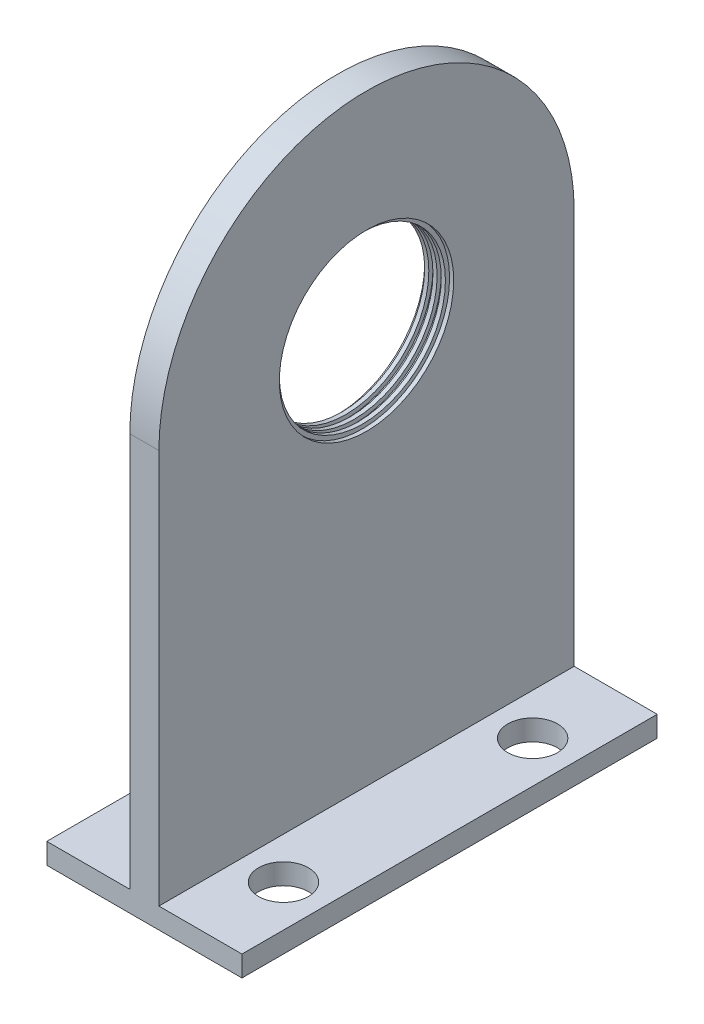
ISO-10303-21;
HEADER;
FILE_DESCRIPTION(('STEP AP214'),'2;1');
FILE_NAME('part.step','',(''),(''),'','','');
FILE_SCHEMA(('AUTOMOTIVE_DESIGN { 1 0 10303 214 1 1 1 1 }'));
ENDSEC;
DATA;
#1=APPLICATION_CONTEXT('core data for automotive mechanical design processes');
#2=APPLICATION_PROTOCOL_DEFINITION('international standard','automotive_design',2000,#1);
#3=PRODUCT_CONTEXT('',#1,'mechanical');
#4=PRODUCT('Part','Part','',(#3));
#5=PRODUCT_RELATED_PRODUCT_CATEGORY('part','',(#4));
#6=PRODUCT_DEFINITION_FORMATION('','',#4);
#7=PRODUCT_DEFINITION_CONTEXT('part definition',#1,'design');
#8=PRODUCT_DEFINITION('design','',#6,#7);
#9=PRODUCT_DEFINITION_SHAPE('','',#8);
#10=(LENGTH_UNIT() NAMED_UNIT(*) SI_UNIT(.MILLI.,.METRE.));
#11=(NAMED_UNIT(*) PLANE_ANGLE_UNIT() SI_UNIT($,.RADIAN.));
#12=(NAMED_UNIT(*) SI_UNIT($,.STERADIAN.) SOLID_ANGLE_UNIT());
#13=UNCERTAINTY_MEASURE_WITH_UNIT(LENGTH_MEASURE(1.E-05),#10,'distance_accuracy_value','');
#14=(GEOMETRIC_REPRESENTATION_CONTEXT(3) GLOBAL_UNCERTAINTY_ASSIGNED_CONTEXT((#13)) GLOBAL_UNIT_ASSIGNED_CONTEXT((#10,
#11,#12)) REPRESENTATION_CONTEXT('',''));
#15=CARTESIAN_POINT('',(0.,0.,0.));
#16=DIRECTION('',(0.,0.,1.));
#17=DIRECTION('',(1.,0.,0.));
#18=AXIS2_PLACEMENT_3D('',#15,#16,#17);
#19=CARTESIAN_POINT('',(0.7,10.,0.));
#20=DIRECTION('',(-1.,0.,0.));
#21=DIRECTION('',(0.,0.,1.));
#22=AXIS2_PLACEMENT_3D('',#19,#20,#21);
#23=CYLINDRICAL_SURFACE('',#22,2.);
#24=CARTESIAN_POINT('',(0.1,10.,0.));
#25=DIRECTION('',(1.,0.,0.));
#26=DIRECTION('',(0.,0.,-1.));
#27=AXIS2_PLACEMENT_3D('',#24,#25,#26);
#28=CIRCLE('',#27,2.);
#29=CARTESIAN_POINT('',(0.1,10.,-1.99999999999999));
#30=VERTEX_POINT('',#29);
#31=EDGE_CURVE('E178',#30,#30,#28,.T.);
#32=ORIENTED_EDGE('',*,*,#31,.F.);
#33=EDGE_LOOP('',(#32));
#34=FACE_BOUND('',#33,.T.);
#35=CARTESIAN_POINT('',(0.2,10.,0.));
#36=DIRECTION('',(1.,0.,0.));
#37=DIRECTION('',(0.,0.,-1.));
#38=AXIS2_PLACEMENT_3D('',#35,#36,#37);
#39=CIRCLE('',#38,2.);
#40=CARTESIAN_POINT('',(0.2,10.,-1.99999999999999));
#41=VERTEX_POINT('',#40);
#42=EDGE_CURVE('E43',#41,#41,#39,.T.);
#43=ORIENTED_EDGE('',*,*,#42,.T.);
#44=EDGE_LOOP('',(#43));
#45=FACE_BOUND('',#44,.T.);
#46=ADVANCED_FACE('F39',(#34,#45),#23,.F.);
#47=CARTESIAN_POINT('',(0.3,10.,0.));
#48=DIRECTION('',(1.,0.,0.));
#49=DIRECTION('',(0.,0.,-1.));
#50=AXIS2_PLACEMENT_3D('',#47,#48,#49);
#51=CIRCLE('',#50,2.);
#52=CARTESIAN_POINT('',(0.3,10.,-1.99999999999999));
#53=VERTEX_POINT('',#52);
#54=EDGE_CURVE('E157',#53,#53,#51,.T.);
#55=ORIENTED_EDGE('',*,*,#54,.F.);
#56=EDGE_LOOP('',(#55));
#57=FACE_BOUND('',#56,.T.);
#58=CARTESIAN_POINT('',(0.4,10.,0.));
#59=DIRECTION('',(1.,0.,0.));
#60=DIRECTION('',(0.,0.,-1.));
#61=AXIS2_PLACEMENT_3D('',#58,#59,#60);
#62=CIRCLE('',#61,2.);
#63=CARTESIAN_POINT('',(0.4,10.,-1.99999999999999));
#64=VERTEX_POINT('',#63);
#65=EDGE_CURVE('E174',#64,#64,#62,.T.);
#66=ORIENTED_EDGE('',*,*,#65,.T.);
#67=EDGE_LOOP('',(#66));
#68=FACE_BOUND('',#67,.T.);
#69=ADVANCED_FACE('F238',(#57,#68),#23,.F.);
#70=CARTESIAN_POINT('',(0.5,10.,0.));
#71=DIRECTION('',(1.,0.,0.));
#72=DIRECTION('',(0.,0.,-1.));
#73=AXIS2_PLACEMENT_3D('',#70,#71,#72);
#74=CIRCLE('',#73,2.);
#75=CARTESIAN_POINT('',(0.5,10.,-1.99999999999999));
#76=VERTEX_POINT('',#75);
#77=EDGE_CURVE('E163',#76,#76,#74,.T.);
#78=ORIENTED_EDGE('',*,*,#77,.F.);
#79=EDGE_LOOP('',(#78));
#80=FACE_BOUND('',#79,.T.);
#81=CARTESIAN_POINT('',(0.6,10.,0.));
#82=DIRECTION('',(1.,0.,0.));
#83=DIRECTION('',(0.,0.,-1.));
#84=AXIS2_PLACEMENT_3D('',#81,#82,#83);
#85=CIRCLE('',#84,2.);
#86=CARTESIAN_POINT('',(0.6,10.,-1.99999999999999));
#87=VERTEX_POINT('',#86);
#88=EDGE_CURVE('E170',#87,#87,#85,.T.);
#89=ORIENTED_EDGE('',*,*,#88,.T.);
#90=EDGE_LOOP('',(#89));
#91=FACE_BOUND('',#90,.T.);
#92=ADVANCED_FACE('F241',(#80,#91),#23,.F.);
#93=CARTESIAN_POINT('',(0.7,10.,0.));
#94=DIRECTION('',(-1.,0.,0.));
#95=DIRECTION('',(0.,0.,1.));
#96=AXIS2_PLACEMENT_3D('',#93,#94,#95);
#97=PLANE('',#96);
#98=CARTESIAN_POINT('',(0.7,10.,0.));
#99=DIRECTION('',(1.,0.,0.));
#100=DIRECTION('',(0.,0.,-1.));
#101=AXIS2_PLACEMENT_3D('',#98,#99,#100);
#102=CIRCLE('',#101,2.1);
#103=CARTESIAN_POINT('',(0.7,10.,-2.09999999999999));
#104=VERTEX_POINT('',#103);
#105=EDGE_CURVE('E171',#104,#104,#102,.T.);
#106=ORIENTED_EDGE('',*,*,#105,.F.);
#107=EDGE_LOOP('',(#106));
#108=FACE_BOUND('',#107,.T.);
#109=DIRECTION('',(0.,-1.,0.));
#110=VECTOR('',#109,1.);
#111=CARTESIAN_POINT('',(0.7,0.,5.00000000000001));
#112=LINE('',#111,#110);
#113=CARTESIAN_POINT('',(0.7,10.,5.00000000000001));
#114=VERTEX_POINT('',#113);
#115=CARTESIAN_POINT('',(0.7,0.5,5.00000000000001));
#116=VERTEX_POINT('',#115);
#117=EDGE_CURVE('E56',#114,#116,#112,.T.);
#118=ORIENTED_EDGE('',*,*,#117,.T.);
#119=DIRECTION('',(0.,0.,-1.));
#120=VECTOR('',#119,1.);
#121=CARTESIAN_POINT('',(0.7,0.5,0.));
#122=LINE('',#121,#120);
#123=CARTESIAN_POINT('',(0.7,0.5,-4.99999999999999));
#124=VERTEX_POINT('',#123);
#125=EDGE_CURVE('E60',#116,#124,#122,.T.);
#126=ORIENTED_EDGE('',*,*,#125,.T.);
#127=DIRECTION('',(0.,1.,0.));
#128=VECTOR('',#127,1.);
#129=CARTESIAN_POINT('',(0.7,0.,-4.99999999999999));
#130=LINE('',#129,#128);
#131=CARTESIAN_POINT('',(0.7,10.,-4.99999999999999));
#132=VERTEX_POINT('',#131);
#133=EDGE_CURVE('E183',#124,#132,#130,.T.);
#134=ORIENTED_EDGE('',*,*,#133,.T.);
#135=CARTESIAN_POINT('',(0.7,10.,0.));
#136=DIRECTION('',(1.,0.,0.));
#137=DIRECTION('',(0.,0.,1.));
#138=AXIS2_PLACEMENT_3D('',#135,#136,#137);
#139=CIRCLE('',#138,5.);
#140=EDGE_CURVE('E186',#132,#114,#139,.T.);
#141=ORIENTED_EDGE('',*,*,#140,.T.);
#142=EDGE_LOOP('',(#118,#126,#134,#141));
#143=FACE_BOUND('',#142,.T.);
#144=ADVANCED_FACE('F250',(#108,#143),#97,.F.);
#145=CARTESIAN_POINT('',(0.,10.,0.));
#146=DIRECTION('',(-1.,0.,0.));
#147=DIRECTION('',(0.,0.,1.));
#148=AXIS2_PLACEMENT_3D('',#145,#146,#147);
#149=PLANE('',#148);
#150=DIRECTION('',(0.,0.,-1.));
#151=VECTOR('',#150,1.);
#152=CARTESIAN_POINT('',(0.,0.5,0.));
#153=LINE('',#152,#151);
#154=CARTESIAN_POINT('',(0.,0.5,5.00000000000001));
#155=VERTEX_POINT('',#154);
#156=CARTESIAN_POINT('',(0.,0.5,-4.99999999999999));
#157=VERTEX_POINT('',#156);
#158=EDGE_CURVE('E146',#155,#157,#153,.T.);
#159=ORIENTED_EDGE('',*,*,#158,.F.);
#160=DIRECTION('',(0.,-1.,0.));
#161=VECTOR('',#160,1.);
#162=CARTESIAN_POINT('',(0.,0.,5.00000000000001));
#163=LINE('',#162,#161);
#164=CARTESIAN_POINT('',(0.,10.,5.00000000000001));
#165=VERTEX_POINT('',#164);
#166=EDGE_CURVE('E189',#165,#155,#163,.T.);
#167=ORIENTED_EDGE('',*,*,#166,.F.);
#168=CARTESIAN_POINT('',(0.,10.,0.));
#169=DIRECTION('',(1.,0.,0.));
#170=DIRECTION('',(0.,0.,1.));
#171=AXIS2_PLACEMENT_3D('',#168,#169,#170);
#172=CIRCLE('',#171,5.);
#173=CARTESIAN_POINT('',(0.,10.,-4.99999999999999));
#174=VERTEX_POINT('',#173);
#175=EDGE_CURVE('E184',#174,#165,#172,.T.);
#176=ORIENTED_EDGE('',*,*,#175,.F.);
#177=DIRECTION('',(0.,1.,0.));
#178=VECTOR('',#177,1.);
#179=CARTESIAN_POINT('',(0.,0.,-4.99999999999999));
#180=LINE('',#179,#178);
#181=EDGE_CURVE('E191',#157,#174,#180,.T.);
#182=ORIENTED_EDGE('',*,*,#181,.F.);
#183=EDGE_LOOP('',(#159,#167,#176,#182));
#184=FACE_BOUND('',#183,.T.);
#185=CARTESIAN_POINT('',(0.,10.,0.));
#186=DIRECTION('',(1.,0.,0.));
#187=DIRECTION('',(0.,0.,-1.));
#188=AXIS2_PLACEMENT_3D('',#185,#186,#187);
#189=CIRCLE('',#188,2.1);
#190=CARTESIAN_POINT('',(0.,10.,-2.09999999999999));
#191=VERTEX_POINT('',#190);
#192=EDGE_CURVE('E179',#191,#191,#189,.T.);
#193=ORIENTED_EDGE('',*,*,#192,.T.);
#194=EDGE_LOOP('',(#193));
#195=FACE_BOUND('',#194,.T.);
#196=ADVANCED_FACE('F255',(#184,#195),#149,.T.);
#197=CARTESIAN_POINT('',(0.7,0.,5.00000000000001));
#198=DIRECTION('',(0.,0.,-1.));
#199=DIRECTION('',(0.,1.,0.));
#200=AXIS2_PLACEMENT_3D('',#197,#198,#199);
#201=PLANE('',#200);
#202=ORIENTED_EDGE('',*,*,#166,.T.);
#203=DIRECTION('',(1.,0.,0.));
#204=VECTOR('',#203,1.);
#205=CARTESIAN_POINT('',(-2.,0.5,5.00000000000001));
#206=LINE('',#205,#204);
#207=CARTESIAN_POINT('',(-2.,0.5,5.00000000000001));
#208=VERTEX_POINT('',#207);
#209=EDGE_CURVE('E144',#208,#155,#206,.T.);
#210=ORIENTED_EDGE('',*,*,#209,.F.);
#211=DIRECTION('',(0.,-1.,0.));
#212=VECTOR('',#211,1.);
#213=CARTESIAN_POINT('',(-2.,0.,5.00000000000001));
#214=LINE('',#213,#212);
#215=CARTESIAN_POINT('',(-2.,0.,5.00000000000001));
#216=VERTEX_POINT('',#215);
#217=EDGE_CURVE('E109',#208,#216,#214,.T.);
#218=ORIENTED_EDGE('',*,*,#217,.T.);
#219=DIRECTION('',(-1.,0.,0.));
#220=VECTOR('',#219,1.);
#221=CARTESIAN_POINT('',(0.7,0.,5.00000000000001));
#222=LINE('',#221,#220);
#223=CARTESIAN_POINT('',(2.7,0.,5.00000000000001));
#224=VERTEX_POINT('',#223);
#225=EDGE_CURVE('E11',#224,#216,#222,.T.);
#226=ORIENTED_EDGE('',*,*,#225,.F.);
#227=DIRECTION('',(0.,-1.,0.));
#228=VECTOR('',#227,1.);
#229=CARTESIAN_POINT('',(2.7,0.,5.00000000000001));
#230=LINE('',#229,#228);
#231=CARTESIAN_POINT('',(2.7,0.5,5.00000000000001));
#232=VERTEX_POINT('',#231);
#233=EDGE_CURVE('E107',#232,#224,#230,.T.);
#234=ORIENTED_EDGE('',*,*,#233,.F.);
#235=EDGE_CURVE('E147',#116,#232,#206,.T.);
#236=ORIENTED_EDGE('',*,*,#235,.F.);
#237=ORIENTED_EDGE('',*,*,#117,.F.);
#238=DIRECTION('',(-1.,0.,0.));
#239=VECTOR('',#238,1.);
#240=CARTESIAN_POINT('',(0.7,10.,5.00000000000001));
#241=LINE('',#240,#239);
#242=EDGE_CURVE('E188',#114,#165,#241,.T.);
#243=ORIENTED_EDGE('',*,*,#242,.T.);
#244=EDGE_LOOP('',(#202,#210,#218,#226,#234,#236,#237,#243));
#245=FACE_BOUND('',#244,.T.);
#246=ADVANCED_FACE('F41',(#245),#201,.F.);
#247=CARTESIAN_POINT('',(0.7,0.,5.00000000000001));
#248=DIRECTION('',(0.,1.,0.));
#249=DIRECTION('',(0.,0.,1.));
#250=AXIS2_PLACEMENT_3D('',#247,#248,#249);
#251=PLANE('',#250);
#252=CARTESIAN_POINT('',(-1.,0.,-3.));
#253=DIRECTION('',(0.,1.,0.));
#254=DIRECTION('',(0.,0.,1.));
#255=AXIS2_PLACEMENT_3D('',#252,#253,#254);
#256=CIRCLE('',#255,0.6);
#257=CARTESIAN_POINT('',(-1.,0.,-2.4));
#258=VERTEX_POINT('',#257);
#259=EDGE_CURVE('E311',#258,#258,#256,.T.);
#260=ORIENTED_EDGE('',*,*,#259,.T.);
#261=EDGE_LOOP('',(#260));
#262=FACE_BOUND('',#261,.T.);
#263=CARTESIAN_POINT('',(-1.,0.,3.));
#264=DIRECTION('',(0.,1.,0.));
#265=DIRECTION('',(0.,0.,1.));
#266=AXIS2_PLACEMENT_3D('',#263,#264,#265);
#267=CIRCLE('',#266,0.6);
#268=CARTESIAN_POINT('',(-1.,0.,3.6));
#269=VERTEX_POINT('',#268);
#270=EDGE_CURVE('E315',#269,#269,#267,.T.);
#271=ORIENTED_EDGE('',*,*,#270,.T.);
#272=EDGE_LOOP('',(#271));
#273=FACE_BOUND('',#272,.T.);
#274=CARTESIAN_POINT('',(1.7,0.,-3.));
#275=DIRECTION('',(0.,1.,0.));
#276=DIRECTION('',(0.,0.,1.));
#277=AXIS2_PLACEMENT_3D('',#274,#275,#276);
#278=CIRCLE('',#277,0.6);
#279=CARTESIAN_POINT('',(1.7,0.,-2.4));
#280=VERTEX_POINT('',#279);
#281=EDGE_CURVE('E125',#280,#280,#278,.T.);
#282=ORIENTED_EDGE('',*,*,#281,.T.);
#283=EDGE_LOOP('',(#282));
#284=FACE_BOUND('',#283,.T.);
#285=CARTESIAN_POINT('',(1.7,0.,3.));
#286=DIRECTION('',(0.,1.,0.));
#287=DIRECTION('',(0.,0.,1.));
#288=AXIS2_PLACEMENT_3D('',#285,#286,#287);
#289=CIRCLE('',#288,0.6);
#290=CARTESIAN_POINT('',(1.7,0.,3.6));
#291=VERTEX_POINT('',#290);
#292=EDGE_CURVE('E128',#291,#291,#289,.T.);
#293=ORIENTED_EDGE('',*,*,#292,.T.);
#294=EDGE_LOOP('',(#293));
#295=FACE_BOUND('',#294,.T.);
#296=ORIENTED_EDGE('',*,*,#225,.T.);
#297=DIRECTION('',(0.,0.,-1.));
#298=VECTOR('',#297,1.);
#299=CARTESIAN_POINT('',(-2.,0.,5.00000000000001));
#300=LINE('',#299,#298);
#301=CARTESIAN_POINT('',(-2.,0.,-4.99999999999999));
#302=VERTEX_POINT('',#301);
#303=EDGE_CURVE('E135',#216,#302,#300,.T.);
#304=ORIENTED_EDGE('',*,*,#303,.T.);
#305=DIRECTION('',(-1.,0.,0.));
#306=VECTOR('',#305,1.);
#307=CARTESIAN_POINT('',(0.7,0.,-4.99999999999999));
#308=LINE('',#307,#306);
#309=CARTESIAN_POINT('',(2.7,0.,-4.99999999999999));
#310=VERTEX_POINT('',#309);
#311=EDGE_CURVE('E48',#310,#302,#308,.T.);
#312=ORIENTED_EDGE('',*,*,#311,.F.);
#313=DIRECTION('',(0.,0.,-1.));
#314=VECTOR('',#313,1.);
#315=CARTESIAN_POINT('',(2.7,0.,5.00000000000001));
#316=LINE('',#315,#314);
#317=EDGE_CURVE('E114',#224,#310,#316,.T.);
#318=ORIENTED_EDGE('',*,*,#317,.F.);
#319=EDGE_LOOP('',(#296,#304,#312,#318));
#320=FACE_BOUND('',#319,.T.);
#321=ADVANCED_FACE('F115',(#262,#273,#284,#295,#320),#251,.F.);
#322=CARTESIAN_POINT('',(0.7,0.,-4.99999999999999));
#323=DIRECTION('',(0.,0.,1.));
#324=DIRECTION('',(0.,-1.,0.));
#325=AXIS2_PLACEMENT_3D('',#322,#323,#324);
#326=PLANE('',#325);
#327=ORIENTED_EDGE('',*,*,#133,.F.);
#328=DIRECTION('',(1.,0.,0.));
#329=VECTOR('',#328,1.);
#330=CARTESIAN_POINT('',(-2.,0.5,-4.99999999999999));
#331=LINE('',#330,#329);
#332=CARTESIAN_POINT('',(2.7,0.5,-4.99999999999999));
#333=VERTEX_POINT('',#332);
#334=EDGE_CURVE('E143',#124,#333,#331,.T.);
#335=ORIENTED_EDGE('',*,*,#334,.T.);
#336=DIRECTION('',(0.,1.,0.));
#337=VECTOR('',#336,1.);
#338=CARTESIAN_POINT('',(2.7,0.,-4.99999999999999));
#339=LINE('',#338,#337);
#340=EDGE_CURVE('E119',#310,#333,#339,.T.);
#341=ORIENTED_EDGE('',*,*,#340,.F.);
#342=ORIENTED_EDGE('',*,*,#311,.T.);
#343=DIRECTION('',(0.,1.,0.));
#344=VECTOR('',#343,1.);
#345=CARTESIAN_POINT('',(-2.,0.,-4.99999999999999));
#346=LINE('',#345,#344);
#347=CARTESIAN_POINT('',(-2.,0.5,-4.99999999999999));
#348=VERTEX_POINT('',#347);
#349=EDGE_CURVE('E137',#302,#348,#346,.T.);
#350=ORIENTED_EDGE('',*,*,#349,.T.);
#351=EDGE_CURVE('E148',#348,#157,#331,.T.);
#352=ORIENTED_EDGE('',*,*,#351,.T.);
#353=ORIENTED_EDGE('',*,*,#181,.T.);
#354=DIRECTION('',(-1.,0.,0.));
#355=VECTOR('',#354,1.);
#356=CARTESIAN_POINT('',(0.7,10.,-4.99999999999999));
#357=LINE('',#356,#355);
#358=EDGE_CURVE('E196',#132,#174,#357,.T.);
#359=ORIENTED_EDGE('',*,*,#358,.F.);
#360=EDGE_LOOP('',(#327,#335,#341,#342,#350,#352,#353,#359));
#361=FACE_BOUND('',#360,.T.);
#362=ADVANCED_FACE('F287',(#361),#326,.F.);
#363=CARTESIAN_POINT('',(0.7,10.,0.));
#364=DIRECTION('',(-1.,0.,0.));
#365=DIRECTION('',(0.,0.,1.));
#366=AXIS2_PLACEMENT_3D('',#363,#364,#365);
#367=CYLINDRICAL_SURFACE('',#366,5.);
#368=ORIENTED_EDGE('',*,*,#175,.T.);
#369=ORIENTED_EDGE('',*,*,#242,.F.);
#370=ORIENTED_EDGE('',*,*,#140,.F.);
#371=ORIENTED_EDGE('',*,*,#358,.T.);
#372=EDGE_LOOP('',(#368,#369,#370,#371));
#373=FACE_BOUND('',#372,.T.);
#374=ADVANCED_FACE('F282',(#373),#367,.T.);
#375=CARTESIAN_POINT('',(0.1,10.,0.));
#376=DIRECTION('',(-1.,0.,0.));
#377=DIRECTION('',(0.,0.,1.));
#378=AXIS2_PLACEMENT_3D('',#375,#376,#377);
#379=CYLINDRICAL_SURFACE('',#378,2.1);
#380=CARTESIAN_POINT('',(0.1,10.,0.));
#381=DIRECTION('',(1.,0.,0.));
#382=DIRECTION('',(0.,0.,-1.));
#383=AXIS2_PLACEMENT_3D('',#380,#381,#382);
#384=CIRCLE('',#383,2.1);
#385=CARTESIAN_POINT('',(0.1,10.,-2.09999999999999));
#386=VERTEX_POINT('',#385);
#387=EDGE_CURVE('E175',#386,#386,#384,.T.);
#388=ORIENTED_EDGE('',*,*,#387,.T.);
#389=EDGE_LOOP('',(#388));
#390=FACE_BOUND('',#389,.T.);
#391=ORIENTED_EDGE('',*,*,#192,.F.);
#392=EDGE_LOOP('',(#391));
#393=FACE_BOUND('',#392,.T.);
#394=ADVANCED_FACE('F277',(#390,#393),#379,.F.);
#395=CARTESIAN_POINT('',(0.1,10.,0.));
#396=DIRECTION('',(1.,0.,0.));
#397=DIRECTION('',(0.,0.,-1.));
#398=AXIS2_PLACEMENT_3D('',#395,#396,#397);
#399=PLANE('',#398);
#400=ORIENTED_EDGE('',*,*,#31,.T.);
#401=EDGE_LOOP('',(#400));
#402=FACE_BOUND('',#401,.T.);
#403=ORIENTED_EDGE('',*,*,#387,.F.);
#404=EDGE_LOOP('',(#403));
#405=FACE_BOUND('',#404,.T.);
#406=ADVANCED_FACE('F271',(#402,#405),#399,.F.);
#407=CARTESIAN_POINT('',(0.6,10.,0.));
#408=DIRECTION('',(1.,0.,0.));
#409=DIRECTION('',(0.,0.,-1.));
#410=AXIS2_PLACEMENT_3D('',#407,#408,#409);
#411=CYLINDRICAL_SURFACE('',#410,2.1);
#412=CARTESIAN_POINT('',(0.6,10.,0.));
#413=DIRECTION('',(1.,0.,0.));
#414=DIRECTION('',(0.,0.,-1.));
#415=AXIS2_PLACEMENT_3D('',#412,#413,#414);
#416=CIRCLE('',#415,2.1);
#417=CARTESIAN_POINT('',(0.6,10.,-2.09999999999999));
#418=VERTEX_POINT('',#417);
#419=EDGE_CURVE('E167',#418,#418,#416,.T.);
#420=ORIENTED_EDGE('',*,*,#419,.F.);
#421=EDGE_LOOP('',(#420));
#422=FACE_BOUND('',#421,.T.);
#423=ORIENTED_EDGE('',*,*,#105,.T.);
#424=EDGE_LOOP('',(#423));
#425=FACE_BOUND('',#424,.T.);
#426=ADVANCED_FACE('F265',(#422,#425),#411,.F.);
#427=CARTESIAN_POINT('',(0.6,10.,0.));
#428=DIRECTION('',(1.,0.,0.));
#429=DIRECTION('',(0.,0.,-1.));
#430=AXIS2_PLACEMENT_3D('',#427,#428,#429);
#431=PLANE('',#430);
#432=ORIENTED_EDGE('',*,*,#88,.F.);
#433=EDGE_LOOP('',(#432));
#434=FACE_BOUND('',#433,.T.);
#435=ORIENTED_EDGE('',*,*,#419,.T.);
#436=EDGE_LOOP('',(#435));
#437=FACE_BOUND('',#436,.T.);
#438=ADVANCED_FACE('F261',(#434,#437),#431,.T.);
#439=CARTESIAN_POINT('',(0.4,10.,0.));
#440=DIRECTION('',(1.,0.,0.));
#441=DIRECTION('',(0.,0.,-1.));
#442=AXIS2_PLACEMENT_3D('',#439,#440,#441);
#443=CYLINDRICAL_SURFACE('',#442,2.1);
#444=CARTESIAN_POINT('',(0.4,10.,0.));
#445=DIRECTION('',(1.,0.,0.));
#446=DIRECTION('',(0.,0.,-1.));
#447=AXIS2_PLACEMENT_3D('',#444,#445,#446);
#448=CIRCLE('',#447,2.1);
#449=CARTESIAN_POINT('',(0.4,10.,-2.09999999999999));
#450=VERTEX_POINT('',#449);
#451=EDGE_CURVE('E160',#450,#450,#448,.T.);
#452=ORIENTED_EDGE('',*,*,#451,.F.);
#453=EDGE_LOOP('',(#452));
#454=FACE_BOUND('',#453,.T.);
#455=CARTESIAN_POINT('',(0.5,10.,0.));
#456=DIRECTION('',(1.,0.,0.));
#457=DIRECTION('',(0.,0.,-1.));
#458=AXIS2_PLACEMENT_3D('',#455,#456,#457);
#459=CIRCLE('',#458,2.1);
#460=CARTESIAN_POINT('',(0.5,10.,-2.09999999999999));
#461=VERTEX_POINT('',#460);
#462=EDGE_CURVE('E164',#461,#461,#459,.T.);
#463=ORIENTED_EDGE('',*,*,#462,.T.);
#464=EDGE_LOOP('',(#463));
#465=FACE_BOUND('',#464,.T.);
#466=ADVANCED_FACE('F264',(#454,#465),#443,.F.);
#467=CARTESIAN_POINT('',(0.4,10.,0.));
#468=DIRECTION('',(1.,0.,0.));
#469=DIRECTION('',(0.,0.,-1.));
#470=AXIS2_PLACEMENT_3D('',#467,#468,#469);
#471=PLANE('',#470);
#472=ORIENTED_EDGE('',*,*,#65,.F.);
#473=EDGE_LOOP('',(#472));
#474=FACE_BOUND('',#473,.T.);
#475=ORIENTED_EDGE('',*,*,#451,.T.);
#476=EDGE_LOOP('',(#475));
#477=FACE_BOUND('',#476,.T.);
#478=ADVANCED_FACE('F483',(#474,#477),#471,.T.);
#479=CARTESIAN_POINT('',(0.5,10.,0.));
#480=DIRECTION('',(1.,0.,0.));
#481=DIRECTION('',(0.,0.,-1.));
#482=AXIS2_PLACEMENT_3D('',#479,#480,#481);
#483=PLANE('',#482);
#484=ORIENTED_EDGE('',*,*,#77,.T.);
#485=EDGE_LOOP('',(#484));
#486=FACE_BOUND('',#485,.T.);
#487=ORIENTED_EDGE('',*,*,#462,.F.);
#488=EDGE_LOOP('',(#487));
#489=FACE_BOUND('',#488,.T.);
#490=ADVANCED_FACE('F224',(#486,#489),#483,.F.);
#491=CARTESIAN_POINT('',(0.2,10.,0.));
#492=DIRECTION('',(1.,0.,0.));
#493=DIRECTION('',(0.,0.,-1.));
#494=AXIS2_PLACEMENT_3D('',#491,#492,#493);
#495=CYLINDRICAL_SURFACE('',#494,2.1);
#496=CARTESIAN_POINT('',(0.2,10.,0.));
#497=DIRECTION('',(1.,0.,0.));
#498=DIRECTION('',(0.,0.,-1.));
#499=AXIS2_PLACEMENT_3D('',#496,#497,#498);
#500=CIRCLE('',#499,2.1);
#501=CARTESIAN_POINT('',(0.2,10.,-2.09999999999999));
#502=VERTEX_POINT('',#501);
#503=EDGE_CURVE('E154',#502,#502,#500,.T.);
#504=ORIENTED_EDGE('',*,*,#503,.F.);
#505=EDGE_LOOP('',(#504));
#506=FACE_BOUND('',#505,.T.);
#507=CARTESIAN_POINT('',(0.3,10.,0.));
#508=DIRECTION('',(1.,0.,0.));
#509=DIRECTION('',(0.,0.,-1.));
#510=AXIS2_PLACEMENT_3D('',#507,#508,#509);
#511=CIRCLE('',#510,2.1);
#512=CARTESIAN_POINT('',(0.3,10.,-2.09999999999999));
#513=VERTEX_POINT('',#512);
#514=EDGE_CURVE('E153',#513,#513,#511,.T.);
#515=ORIENTED_EDGE('',*,*,#514,.T.);
#516=EDGE_LOOP('',(#515));
#517=FACE_BOUND('',#516,.T.);
#518=ADVANCED_FACE('F218',(#506,#517),#495,.F.);
#519=CARTESIAN_POINT('',(0.2,10.,0.));
#520=DIRECTION('',(1.,0.,0.));
#521=DIRECTION('',(0.,0.,-1.));
#522=AXIS2_PLACEMENT_3D('',#519,#520,#521);
#523=PLANE('',#522);
#524=ORIENTED_EDGE('',*,*,#42,.F.);
#525=EDGE_LOOP('',(#524));
#526=FACE_BOUND('',#525,.T.);
#527=ORIENTED_EDGE('',*,*,#503,.T.);
#528=EDGE_LOOP('',(#527));
#529=FACE_BOUND('',#528,.T.);
#530=ADVANCED_FACE('F214',(#526,#529),#523,.T.);
#531=CARTESIAN_POINT('',(0.3,10.,0.));
#532=DIRECTION('',(1.,0.,0.));
#533=DIRECTION('',(0.,0.,-1.));
#534=AXIS2_PLACEMENT_3D('',#531,#532,#533);
#535=PLANE('',#534);
#536=ORIENTED_EDGE('',*,*,#54,.T.);
#537=EDGE_LOOP('',(#536));
#538=FACE_BOUND('',#537,.T.);
#539=ORIENTED_EDGE('',*,*,#514,.F.);
#540=EDGE_LOOP('',(#539));
#541=FACE_BOUND('',#540,.T.);
#542=ADVANCED_FACE('F217',(#538,#541),#535,.F.);
#543=CARTESIAN_POINT('',(-2.,0.,0.));
#544=DIRECTION('',(-1.,0.,0.));
#545=DIRECTION('',(0.,0.,1.));
#546=AXIS2_PLACEMENT_3D('',#543,#544,#545);
#547=PLANE('',#546);
#548=ORIENTED_EDGE('',*,*,#217,.F.);
#549=DIRECTION('',(0.,0.,1.));
#550=VECTOR('',#549,1.);
#551=CARTESIAN_POINT('',(-2.,0.5,5.00000000000001));
#552=LINE('',#551,#550);
#553=EDGE_CURVE('E140',#348,#208,#552,.T.);
#554=ORIENTED_EDGE('',*,*,#553,.F.);
#555=ORIENTED_EDGE('',*,*,#349,.F.);
#556=ORIENTED_EDGE('',*,*,#303,.F.);
#557=EDGE_LOOP('',(#548,#554,#555,#556));
#558=FACE_BOUND('',#557,.T.);
#559=ADVANCED_FACE('F229',(#558),#547,.T.);
#560=CARTESIAN_POINT('',(-2.,0.5,5.00000000000001));
#561=DIRECTION('',(0.,1.,0.));
#562=DIRECTION('',(0.,0.,1.));
#563=AXIS2_PLACEMENT_3D('',#560,#561,#562);
#564=PLANE('',#563);
#565=CARTESIAN_POINT('',(-1.,0.5,-3.));
#566=DIRECTION('',(0.,1.,0.));
#567=DIRECTION('',(0.,0.,1.));
#568=AXIS2_PLACEMENT_3D('',#565,#566,#567);
#569=CIRCLE('',#568,0.6);
#570=CARTESIAN_POINT('',(-1.,0.5,-2.4));
#571=VERTEX_POINT('',#570);
#572=EDGE_CURVE('E330',#571,#571,#569,.T.);
#573=ORIENTED_EDGE('',*,*,#572,.F.);
#574=EDGE_LOOP('',(#573));
#575=FACE_BOUND('',#574,.T.);
#576=CARTESIAN_POINT('',(-1.,0.5,3.));
#577=DIRECTION('',(0.,1.,0.));
#578=DIRECTION('',(0.,0.,1.));
#579=AXIS2_PLACEMENT_3D('',#576,#577,#578);
#580=CIRCLE('',#579,0.6);
#581=CARTESIAN_POINT('',(-1.,0.5,3.6));
#582=VERTEX_POINT('',#581);
#583=EDGE_CURVE('E331',#582,#582,#580,.T.);
#584=ORIENTED_EDGE('',*,*,#583,.F.);
#585=EDGE_LOOP('',(#584));
#586=FACE_BOUND('',#585,.T.);
#587=ORIENTED_EDGE('',*,*,#209,.T.);
#588=ORIENTED_EDGE('',*,*,#158,.T.);
#589=ORIENTED_EDGE('',*,*,#351,.F.);
#590=ORIENTED_EDGE('',*,*,#553,.T.);
#591=EDGE_LOOP('',(#587,#588,#589,#590));
#592=FACE_BOUND('',#591,.T.);
#593=ADVANCED_FACE('F234',(#575,#586,#592),#564,.T.);
#594=CARTESIAN_POINT('',(1.7,0.5,-3.));
#595=DIRECTION('',(0.,1.,0.));
#596=DIRECTION('',(0.,0.,1.));
#597=AXIS2_PLACEMENT_3D('',#594,#595,#596);
#598=CIRCLE('',#597,0.6);
#599=CARTESIAN_POINT('',(1.7,0.5,-2.4));
#600=VERTEX_POINT('',#599);
#601=EDGE_CURVE('E321',#600,#600,#598,.T.);
#602=ORIENTED_EDGE('',*,*,#601,.F.);
#603=EDGE_LOOP('',(#602));
#604=FACE_BOUND('',#603,.T.);
#605=CARTESIAN_POINT('',(1.7,0.5,3.));
#606=DIRECTION('',(0.,1.,0.));
#607=DIRECTION('',(0.,0.,1.));
#608=AXIS2_PLACEMENT_3D('',#605,#606,#607);
#609=CIRCLE('',#608,0.6);
#610=CARTESIAN_POINT('',(1.7,0.5,3.6));
#611=VERTEX_POINT('',#610);
#612=EDGE_CURVE('E323',#611,#611,#609,.T.);
#613=ORIENTED_EDGE('',*,*,#612,.F.);
#614=EDGE_LOOP('',(#613));
#615=FACE_BOUND('',#614,.T.);
#616=ORIENTED_EDGE('',*,*,#125,.F.);
#617=ORIENTED_EDGE('',*,*,#235,.T.);
#618=DIRECTION('',(0.,0.,1.));
#619=VECTOR('',#618,1.);
#620=CARTESIAN_POINT('',(2.7,0.5,5.00000000000001));
#621=LINE('',#620,#619);
#622=EDGE_CURVE('E124',#333,#232,#621,.T.);
#623=ORIENTED_EDGE('',*,*,#622,.F.);
#624=ORIENTED_EDGE('',*,*,#334,.F.);
#625=EDGE_LOOP('',(#616,#617,#623,#624));
#626=FACE_BOUND('',#625,.T.);
#627=ADVANCED_FACE('F342',(#604,#615,#626),#564,.T.);
#628=CARTESIAN_POINT('',(2.7,0.,0.));
#629=DIRECTION('',(-1.,0.,0.));
#630=DIRECTION('',(0.,0.,1.));
#631=AXIS2_PLACEMENT_3D('',#628,#629,#630);
#632=PLANE('',#631);
#633=ORIENTED_EDGE('',*,*,#233,.T.);
#634=ORIENTED_EDGE('',*,*,#317,.T.);
#635=ORIENTED_EDGE('',*,*,#340,.T.);
#636=ORIENTED_EDGE('',*,*,#622,.T.);
#637=EDGE_LOOP('',(#633,#634,#635,#636));
#638=FACE_BOUND('',#637,.T.);
#639=ADVANCED_FACE('F122',(#638),#632,.F.);
#640=CARTESIAN_POINT('',(1.7,-2.2,3.));
#641=DIRECTION('',(0.,1.,0.));
#642=DIRECTION('',(0.,0.,1.));
#643=AXIS2_PLACEMENT_3D('',#640,#641,#642);
#644=CYLINDRICAL_SURFACE('',#643,0.6);
#645=ORIENTED_EDGE('',*,*,#612,.T.);
#646=EDGE_LOOP('',(#645));
#647=FACE_BOUND('',#646,.T.);
#648=ORIENTED_EDGE('',*,*,#292,.F.);
#649=EDGE_LOOP('',(#648));
#650=FACE_BOUND('',#649,.T.);
#651=ADVANCED_FACE('F361',(#647,#650),#644,.F.);
#652=CARTESIAN_POINT('',(1.7,-2.2,-3.));
#653=DIRECTION('',(0.,1.,0.));
#654=DIRECTION('',(0.,0.,1.));
#655=AXIS2_PLACEMENT_3D('',#652,#653,#654);
#656=CYLINDRICAL_SURFACE('',#655,0.6);
#657=ORIENTED_EDGE('',*,*,#601,.T.);
#658=EDGE_LOOP('',(#657));
#659=FACE_BOUND('',#658,.T.);
#660=ORIENTED_EDGE('',*,*,#281,.F.);
#661=EDGE_LOOP('',(#660));
#662=FACE_BOUND('',#661,.T.);
#663=ADVANCED_FACE('F368',(#659,#662),#656,.F.);
#664=CARTESIAN_POINT('',(-1.,-2.2,3.));
#665=DIRECTION('',(0.,1.,0.));
#666=DIRECTION('',(0.,0.,1.));
#667=AXIS2_PLACEMENT_3D('',#664,#665,#666);
#668=CYLINDRICAL_SURFACE('',#667,0.6);
#669=ORIENTED_EDGE('',*,*,#583,.T.);
#670=EDGE_LOOP('',(#669));
#671=FACE_BOUND('',#670,.T.);
#672=ORIENTED_EDGE('',*,*,#270,.F.);
#673=EDGE_LOOP('',(#672));
#674=FACE_BOUND('',#673,.T.);
#675=ADVANCED_FACE('F372',(#671,#674),#668,.F.);
#676=CARTESIAN_POINT('',(-1.,-2.2,-3.));
#677=DIRECTION('',(0.,1.,0.));
#678=DIRECTION('',(0.,0.,1.));
#679=AXIS2_PLACEMENT_3D('',#676,#677,#678);
#680=CYLINDRICAL_SURFACE('',#679,0.6);
#681=ORIENTED_EDGE('',*,*,#572,.T.);
#682=EDGE_LOOP('',(#681));
#683=FACE_BOUND('',#682,.T.);
#684=ORIENTED_EDGE('',*,*,#259,.F.);
#685=EDGE_LOOP('',(#684));
#686=FACE_BOUND('',#685,.T.);
#687=ADVANCED_FACE('F337',(#683,#686),#680,.F.);
#688=CLOSED_SHELL('',(#46,#69,#92,#144,#196,#246,#321,#362,#374,#394,#406,#426,#438,#466,#478,
#490,#518,#530,#542,#559,#593,#627,#639,#651,#663,#675,#687));
#689=MANIFOLD_SOLID_BREP('B2',#688);
#690=ADVANCED_BREP_SHAPE_REPRESENTATION('',(#18,#689),#14);
#691=SHAPE_DEFINITION_REPRESENTATION(#9,#690);
ENDSEC;
END-ISO-10303-21;
